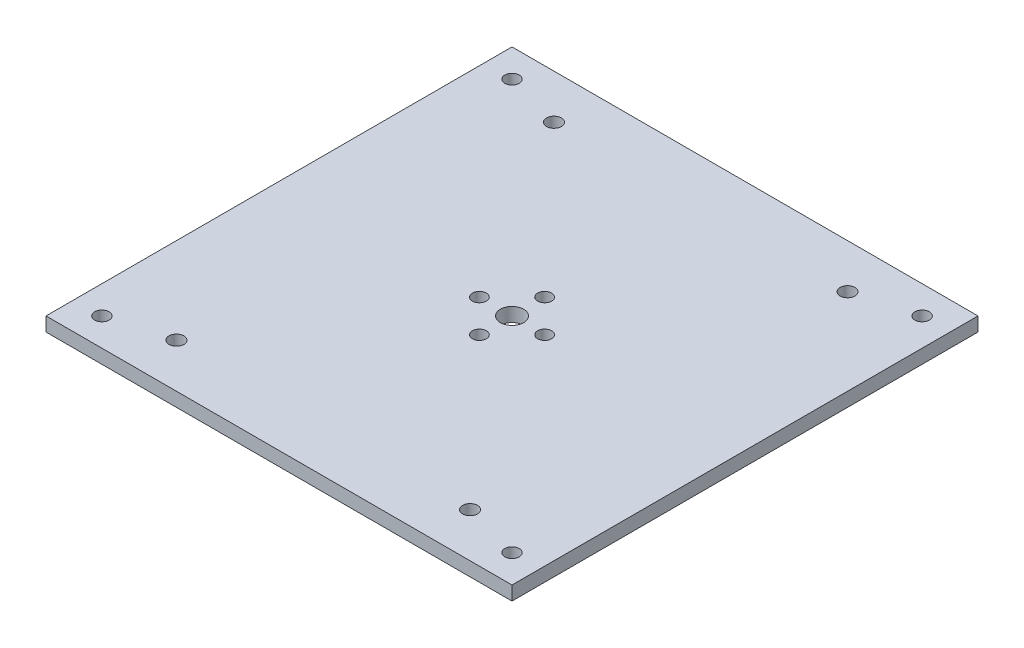
ISO-10303-21;
HEADER;
FILE_DESCRIPTION(('STEP AP214'),'2;1');
FILE_NAME('part.step','',(''),(''),'','','');
FILE_SCHEMA(('AUTOMOTIVE_DESIGN { 1 0 10303 214 1 1 1 1 }'));
ENDSEC;
DATA;
#1=APPLICATION_CONTEXT('core data for automotive mechanical design processes');
#2=APPLICATION_PROTOCOL_DEFINITION('international standard','automotive_design',2000,#1);
#3=PRODUCT_CONTEXT('',#1,'mechanical');
#4=PRODUCT('Part','Part','',(#3));
#5=PRODUCT_RELATED_PRODUCT_CATEGORY('part','',(#4));
#6=PRODUCT_DEFINITION_FORMATION('','',#4);
#7=PRODUCT_DEFINITION_CONTEXT('part definition',#1,'design');
#8=PRODUCT_DEFINITION('design','',#6,#7);
#9=PRODUCT_DEFINITION_SHAPE('','',#8);
#10=(LENGTH_UNIT() NAMED_UNIT(*) SI_UNIT(.MILLI.,.METRE.));
#11=(NAMED_UNIT(*) PLANE_ANGLE_UNIT() SI_UNIT($,.RADIAN.));
#12=(NAMED_UNIT(*) SI_UNIT($,.STERADIAN.) SOLID_ANGLE_UNIT());
#13=UNCERTAINTY_MEASURE_WITH_UNIT(LENGTH_MEASURE(1.E-05),#10,'distance_accuracy_value','');
#14=(GEOMETRIC_REPRESENTATION_CONTEXT(3) GLOBAL_UNCERTAINTY_ASSIGNED_CONTEXT((#13)) GLOBAL_UNIT_ASSIGNED_CONTEXT((#10,
#11,#12)) REPRESENTATION_CONTEXT('',''));
#15=CARTESIAN_POINT('',(0.,0.,0.));
#16=DIRECTION('',(0.,0.,1.));
#17=DIRECTION('',(1.,0.,0.));
#18=AXIS2_PLACEMENT_3D('',#15,#16,#17);
#19=CARTESIAN_POINT('',(-50.,3.,-50.));
#20=DIRECTION('',(1.,0.,0.));
#21=DIRECTION('',(0.,0.,-1.));
#22=AXIS2_PLACEMENT_3D('',#19,#20,#21);
#23=PLANE('',#22);
#24=DIRECTION('',(0.,0.,1.));
#25=VECTOR('',#24,1.);
#26=CARTESIAN_POINT('',(-50.,0.,-50.));
#27=LINE('',#26,#25);
#28=CARTESIAN_POINT('',(-50.,0.,-50.));
#29=VERTEX_POINT('',#28);
#30=CARTESIAN_POINT('',(-50.,0.,50.));
#31=VERTEX_POINT('',#30);
#32=EDGE_CURVE('E98',#29,#31,#27,.T.);
#33=ORIENTED_EDGE('',*,*,#32,.T.);
#34=DIRECTION('',(0.,-1.,0.));
#35=VECTOR('',#34,1.);
#36=CARTESIAN_POINT('',(-50.,3.,50.));
#37=LINE('',#36,#35);
#38=CARTESIAN_POINT('',(-50.,3.,50.));
#39=VERTEX_POINT('',#38);
#40=EDGE_CURVE('E11',#39,#31,#37,.T.);
#41=ORIENTED_EDGE('',*,*,#40,.F.);
#42=DIRECTION('',(0.,0.,1.));
#43=VECTOR('',#42,1.);
#44=CARTESIAN_POINT('',(-50.,3.,-50.));
#45=LINE('',#44,#43);
#46=CARTESIAN_POINT('',(-50.,3.,-50.));
#47=VERTEX_POINT('',#46);
#48=EDGE_CURVE('E85',#47,#39,#45,.T.);
#49=ORIENTED_EDGE('',*,*,#48,.F.);
#50=DIRECTION('',(0.,-1.,0.));
#51=VECTOR('',#50,1.);
#52=CARTESIAN_POINT('',(-50.,3.,-50.));
#53=LINE('',#52,#51);
#54=EDGE_CURVE('E94',#47,#29,#53,.T.);
#55=ORIENTED_EDGE('',*,*,#54,.T.);
#56=EDGE_LOOP('',(#33,#41,#49,#55));
#57=FACE_BOUND('',#56,.T.);
#58=ADVANCED_FACE('F32',(#57),#23,.F.);
#59=CARTESIAN_POINT('',(-50.,3.,50.));
#60=DIRECTION('',(0.,0.,-1.));
#61=DIRECTION('',(-1.,0.,0.));
#62=AXIS2_PLACEMENT_3D('',#59,#60,#61);
#63=PLANE('',#62);
#64=DIRECTION('',(1.,0.,0.));
#65=VECTOR('',#64,1.);
#66=CARTESIAN_POINT('',(-50.,0.,50.));
#67=LINE('',#66,#65);
#68=CARTESIAN_POINT('',(50.,0.,50.));
#69=VERTEX_POINT('',#68);
#70=EDGE_CURVE('E89',#31,#69,#67,.T.);
#71=ORIENTED_EDGE('',*,*,#70,.T.);
#72=DIRECTION('',(0.,-1.,0.));
#73=VECTOR('',#72,1.);
#74=CARTESIAN_POINT('',(50.,3.,50.));
#75=LINE('',#74,#73);
#76=CARTESIAN_POINT('',(50.,3.,50.));
#77=VERTEX_POINT('',#76);
#78=EDGE_CURVE('E41',#77,#69,#75,.T.);
#79=ORIENTED_EDGE('',*,*,#78,.F.);
#80=DIRECTION('',(1.,0.,0.));
#81=VECTOR('',#80,1.);
#82=CARTESIAN_POINT('',(-50.,3.,50.));
#83=LINE('',#82,#81);
#84=EDGE_CURVE('E80',#39,#77,#83,.T.);
#85=ORIENTED_EDGE('',*,*,#84,.F.);
#86=ORIENTED_EDGE('',*,*,#40,.T.);
#87=EDGE_LOOP('',(#71,#79,#85,#86));
#88=FACE_BOUND('',#87,.T.);
#89=ADVANCED_FACE('F88',(#88),#63,.F.);
#90=CARTESIAN_POINT('',(50.,3.,-50.));
#91=DIRECTION('',(-1.,0.,0.));
#92=DIRECTION('',(0.,0.,1.));
#93=AXIS2_PLACEMENT_3D('',#90,#91,#92);
#94=PLANE('',#93);
#95=DIRECTION('',(0.,0.,-1.));
#96=VECTOR('',#95,1.);
#97=CARTESIAN_POINT('',(50.,0.,-50.));
#98=LINE('',#97,#96);
#99=CARTESIAN_POINT('',(50.,0.,-50.));
#100=VERTEX_POINT('',#99);
#101=EDGE_CURVE('E67',#69,#100,#98,.T.);
#102=ORIENTED_EDGE('',*,*,#101,.T.);
#103=DIRECTION('',(0.,-1.,0.));
#104=VECTOR('',#103,1.);
#105=CARTESIAN_POINT('',(50.,3.,-50.));
#106=LINE('',#105,#104);
#107=CARTESIAN_POINT('',(50.,3.,-50.));
#108=VERTEX_POINT('',#107);
#109=EDGE_CURVE('E90',#108,#100,#106,.T.);
#110=ORIENTED_EDGE('',*,*,#109,.F.);
#111=DIRECTION('',(0.,0.,-1.));
#112=VECTOR('',#111,1.);
#113=CARTESIAN_POINT('',(50.,3.,-50.));
#114=LINE('',#113,#112);
#115=EDGE_CURVE('E83',#77,#108,#114,.T.);
#116=ORIENTED_EDGE('',*,*,#115,.F.);
#117=ORIENTED_EDGE('',*,*,#78,.T.);
#118=EDGE_LOOP('',(#102,#110,#116,#117));
#119=FACE_BOUND('',#118,.T.);
#120=ADVANCED_FACE('F92',(#119),#94,.F.);
#121=CARTESIAN_POINT('',(-50.,3.,-50.));
#122=DIRECTION('',(0.,0.,1.));
#123=DIRECTION('',(1.,0.,0.));
#124=AXIS2_PLACEMENT_3D('',#121,#122,#123);
#125=PLANE('',#124);
#126=DIRECTION('',(-1.,0.,0.));
#127=VECTOR('',#126,1.);
#128=CARTESIAN_POINT('',(-50.,0.,-50.));
#129=LINE('',#128,#127);
#130=EDGE_CURVE('E73',#100,#29,#129,.T.);
#131=ORIENTED_EDGE('',*,*,#130,.T.);
#132=ORIENTED_EDGE('',*,*,#54,.F.);
#133=DIRECTION('',(-1.,0.,0.));
#134=VECTOR('',#133,1.);
#135=CARTESIAN_POINT('',(-50.,3.,-50.));
#136=LINE('',#135,#134);
#137=EDGE_CURVE('E50',#108,#47,#136,.T.);
#138=ORIENTED_EDGE('',*,*,#137,.F.);
#139=ORIENTED_EDGE('',*,*,#109,.T.);
#140=EDGE_LOOP('',(#131,#132,#138,#139));
#141=FACE_BOUND('',#140,.T.);
#142=ADVANCED_FACE('F181',(#141),#125,.F.);
#143=CARTESIAN_POINT('',(0.,3.,0.));
#144=DIRECTION('',(0.,1.,0.));
#145=DIRECTION('',(0.,0.,1.));
#146=AXIS2_PLACEMENT_3D('',#143,#144,#145);
#147=PLANE('',#146);
#148=CARTESIAN_POINT('',(0.,3.,-7.));
#149=DIRECTION('',(0.,1.,0.));
#150=DIRECTION('',(0.,0.,1.));
#151=AXIS2_PLACEMENT_3D('',#148,#149,#150);
#152=CIRCLE('',#151,1.5);
#153=CARTESIAN_POINT('',(0.,3.,-5.5));
#154=VERTEX_POINT('',#153);
#155=EDGE_CURVE('E352',#154,#154,#152,.T.);
#156=ORIENTED_EDGE('',*,*,#155,.F.);
#157=EDGE_LOOP('',(#156));
#158=FACE_BOUND('',#157,.T.);
#159=CARTESIAN_POINT('',(7.,3.,0.));
#160=DIRECTION('',(0.,1.,0.));
#161=DIRECTION('',(0.,0.,1.));
#162=AXIS2_PLACEMENT_3D('',#159,#160,#161);
#163=CIRCLE('',#162,1.5);
#164=CARTESIAN_POINT('',(7.,3.,1.5));
#165=VERTEX_POINT('',#164);
#166=EDGE_CURVE('E353',#165,#165,#163,.T.);
#167=ORIENTED_EDGE('',*,*,#166,.F.);
#168=EDGE_LOOP('',(#167));
#169=FACE_BOUND('',#168,.T.);
#170=CARTESIAN_POINT('',(0.,3.,7.));
#171=DIRECTION('',(0.,1.,0.));
#172=DIRECTION('',(0.,0.,1.));
#173=AXIS2_PLACEMENT_3D('',#170,#171,#172);
#174=CIRCLE('',#173,1.5);
#175=CARTESIAN_POINT('',(0.,3.,8.5));
#176=VERTEX_POINT('',#175);
#177=EDGE_CURVE('E357',#176,#176,#174,.T.);
#178=ORIENTED_EDGE('',*,*,#177,.F.);
#179=EDGE_LOOP('',(#178));
#180=FACE_BOUND('',#179,.T.);
#181=CARTESIAN_POINT('',(-7.,3.,0.));
#182=DIRECTION('',(0.,1.,0.));
#183=DIRECTION('',(0.,0.,1.));
#184=AXIS2_PLACEMENT_3D('',#181,#182,#183);
#185=CIRCLE('',#184,1.5);
#186=CARTESIAN_POINT('',(-7.,3.,1.5));
#187=VERTEX_POINT('',#186);
#188=EDGE_CURVE('E359',#187,#187,#185,.T.);
#189=ORIENTED_EDGE('',*,*,#188,.F.);
#190=EDGE_LOOP('',(#189));
#191=FACE_BOUND('',#190,.T.);
#192=CARTESIAN_POINT('',(0.,3.,0.));
#193=DIRECTION('',(0.,1.,0.));
#194=DIRECTION('',(0.,0.,1.));
#195=AXIS2_PLACEMENT_3D('',#192,#193,#194);
#196=CIRCLE('',#195,2.5);
#197=CARTESIAN_POINT('',(0.,3.,2.5));
#198=VERTEX_POINT('',#197);
#199=EDGE_CURVE('E137',#198,#198,#196,.T.);
#200=ORIENTED_EDGE('',*,*,#199,.F.);
#201=EDGE_LOOP('',(#200));
#202=FACE_BOUND('',#201,.T.);
#203=CARTESIAN_POINT('',(31.5,3.,-40.5));
#204=DIRECTION('',(0.,1.,0.));
#205=DIRECTION('',(0.,0.,1.));
#206=AXIS2_PLACEMENT_3D('',#203,#204,#205);
#207=CIRCLE('',#206,1.6);
#208=CARTESIAN_POINT('',(31.5,3.,-38.9));
#209=VERTEX_POINT('',#208);
#210=EDGE_CURVE('E156',#209,#209,#207,.T.);
#211=ORIENTED_EDGE('',*,*,#210,.F.);
#212=EDGE_LOOP('',(#211));
#213=FACE_BOUND('',#212,.T.);
#214=CARTESIAN_POINT('',(-31.5,3.,40.5));
#215=DIRECTION('',(0.,1.,0.));
#216=DIRECTION('',(0.,0.,1.));
#217=AXIS2_PLACEMENT_3D('',#214,#215,#216);
#218=CIRCLE('',#217,1.6);
#219=CARTESIAN_POINT('',(-31.5,3.,42.1));
#220=VERTEX_POINT('',#219);
#221=EDGE_CURVE('E151',#220,#220,#218,.T.);
#222=ORIENTED_EDGE('',*,*,#221,.F.);
#223=EDGE_LOOP('',(#222));
#224=FACE_BOUND('',#223,.T.);
#225=CARTESIAN_POINT('',(31.5,3.,40.5));
#226=DIRECTION('',(0.,1.,0.));
#227=DIRECTION('',(0.,0.,1.));
#228=AXIS2_PLACEMENT_3D('',#225,#226,#227);
#229=CIRCLE('',#228,1.6);
#230=CARTESIAN_POINT('',(31.5,3.,42.1));
#231=VERTEX_POINT('',#230);
#232=EDGE_CURVE('E147',#231,#231,#229,.T.);
#233=ORIENTED_EDGE('',*,*,#232,.F.);
#234=EDGE_LOOP('',(#233));
#235=FACE_BOUND('',#234,.T.);
#236=CARTESIAN_POINT('',(-31.5,3.,-40.5));
#237=DIRECTION('',(0.,1.,0.));
#238=DIRECTION('',(0.,0.,1.));
#239=AXIS2_PLACEMENT_3D('',#236,#237,#238);
#240=CIRCLE('',#239,1.6);
#241=CARTESIAN_POINT('',(-31.5,3.,-38.9));
#242=VERTEX_POINT('',#241);
#243=EDGE_CURVE('E123',#242,#242,#240,.T.);
#244=ORIENTED_EDGE('',*,*,#243,.F.);
#245=EDGE_LOOP('',(#244));
#246=FACE_BOUND('',#245,.T.);
#247=CARTESIAN_POINT('',(-44.,3.,44.));
#248=DIRECTION('',(0.,1.,0.));
#249=DIRECTION('',(0.,0.,1.));
#250=AXIS2_PLACEMENT_3D('',#247,#248,#249);
#251=CIRCLE('',#250,1.55);
#252=CARTESIAN_POINT('',(-44.,3.,45.55));
#253=VERTEX_POINT('',#252);
#254=EDGE_CURVE('E132',#253,#253,#251,.T.);
#255=ORIENTED_EDGE('',*,*,#254,.F.);
#256=EDGE_LOOP('',(#255));
#257=FACE_BOUND('',#256,.T.);
#258=CARTESIAN_POINT('',(44.,3.,44.));
#259=DIRECTION('',(0.,1.,0.));
#260=DIRECTION('',(0.,0.,1.));
#261=AXIS2_PLACEMENT_3D('',#258,#259,#260);
#262=CIRCLE('',#261,1.55);
#263=CARTESIAN_POINT('',(44.,3.,45.55));
#264=VERTEX_POINT('',#263);
#265=EDGE_CURVE('E168',#264,#264,#262,.T.);
#266=ORIENTED_EDGE('',*,*,#265,.F.);
#267=EDGE_LOOP('',(#266));
#268=FACE_BOUND('',#267,.T.);
#269=CARTESIAN_POINT('',(44.,3.,-44.));
#270=DIRECTION('',(0.,1.,0.));
#271=DIRECTION('',(0.,0.,1.));
#272=AXIS2_PLACEMENT_3D('',#269,#270,#271);
#273=CIRCLE('',#272,1.55);
#274=CARTESIAN_POINT('',(44.,3.,-42.45));
#275=VERTEX_POINT('',#274);
#276=EDGE_CURVE('E165',#275,#275,#273,.T.);
#277=ORIENTED_EDGE('',*,*,#276,.F.);
#278=EDGE_LOOP('',(#277));
#279=FACE_BOUND('',#278,.T.);
#280=CARTESIAN_POINT('',(-44.,3.,-44.));
#281=DIRECTION('',(0.,1.,0.));
#282=DIRECTION('',(0.,0.,1.));
#283=AXIS2_PLACEMENT_3D('',#280,#281,#282);
#284=CIRCLE('',#283,1.55);
#285=CARTESIAN_POINT('',(-44.,3.,-42.45));
#286=VERTEX_POINT('',#285);
#287=EDGE_CURVE('E111',#286,#286,#284,.T.);
#288=ORIENTED_EDGE('',*,*,#287,.F.);
#289=EDGE_LOOP('',(#288));
#290=FACE_BOUND('',#289,.T.);
#291=ORIENTED_EDGE('',*,*,#48,.T.);
#292=ORIENTED_EDGE('',*,*,#84,.T.);
#293=ORIENTED_EDGE('',*,*,#115,.T.);
#294=ORIENTED_EDGE('',*,*,#137,.T.);
#295=EDGE_LOOP('',(#291,#292,#293,#294));
#296=FACE_BOUND('',#295,.T.);
#297=ADVANCED_FACE('F81',(#158,#169,#180,#191,#202,#213,#224,#235,#246,#257,#268,#279,#290,
#296),#147,.T.);
#298=CARTESIAN_POINT('',(0.,0.,0.));
#299=DIRECTION('',(0.,1.,0.));
#300=DIRECTION('',(0.,0.,1.));
#301=AXIS2_PLACEMENT_3D('',#298,#299,#300);
#302=PLANE('',#301);
#303=CARTESIAN_POINT('',(0.,0.,-7.));
#304=DIRECTION('',(0.,1.,0.));
#305=DIRECTION('',(0.,0.,1.));
#306=AXIS2_PLACEMENT_3D('',#303,#304,#305);
#307=CIRCLE('',#306,1.5);
#308=CARTESIAN_POINT('',(0.,0.,-5.5));
#309=VERTEX_POINT('',#308);
#310=EDGE_CURVE('E35',#309,#309,#307,.T.);
#311=ORIENTED_EDGE('',*,*,#310,.T.);
#312=EDGE_LOOP('',(#311));
#313=FACE_BOUND('',#312,.T.);
#314=CARTESIAN_POINT('',(7.,0.,0.));
#315=DIRECTION('',(0.,1.,0.));
#316=DIRECTION('',(0.,0.,1.));
#317=AXIS2_PLACEMENT_3D('',#314,#315,#316);
#318=CIRCLE('',#317,1.5);
#319=CARTESIAN_POINT('',(7.,0.,1.5));
#320=VERTEX_POINT('',#319);
#321=EDGE_CURVE('E142',#320,#320,#318,.T.);
#322=ORIENTED_EDGE('',*,*,#321,.T.);
#323=EDGE_LOOP('',(#322));
#324=FACE_BOUND('',#323,.T.);
#325=CARTESIAN_POINT('',(0.,0.,7.));
#326=DIRECTION('',(0.,1.,0.));
#327=DIRECTION('',(0.,0.,1.));
#328=AXIS2_PLACEMENT_3D('',#325,#326,#327);
#329=CIRCLE('',#328,1.5);
#330=CARTESIAN_POINT('',(0.,0.,8.5));
#331=VERTEX_POINT('',#330);
#332=EDGE_CURVE('E140',#331,#331,#329,.T.);
#333=ORIENTED_EDGE('',*,*,#332,.T.);
#334=EDGE_LOOP('',(#333));
#335=FACE_BOUND('',#334,.T.);
#336=CARTESIAN_POINT('',(-7.,0.,0.));
#337=DIRECTION('',(0.,1.,0.));
#338=DIRECTION('',(0.,0.,1.));
#339=AXIS2_PLACEMENT_3D('',#336,#337,#338);
#340=CIRCLE('',#339,1.5);
#341=CARTESIAN_POINT('',(-7.,0.,1.5));
#342=VERTEX_POINT('',#341);
#343=EDGE_CURVE('E136',#342,#342,#340,.T.);
#344=ORIENTED_EDGE('',*,*,#343,.T.);
#345=EDGE_LOOP('',(#344));
#346=FACE_BOUND('',#345,.T.);
#347=CARTESIAN_POINT('',(0.,0.,0.));
#348=DIRECTION('',(0.,1.,0.));
#349=DIRECTION('',(0.,0.,1.));
#350=AXIS2_PLACEMENT_3D('',#347,#348,#349);
#351=CIRCLE('',#350,2.5);
#352=CARTESIAN_POINT('',(0.,0.,2.5));
#353=VERTEX_POINT('',#352);
#354=EDGE_CURVE('E133',#353,#353,#351,.T.);
#355=ORIENTED_EDGE('',*,*,#354,.T.);
#356=EDGE_LOOP('',(#355));
#357=FACE_BOUND('',#356,.T.);
#358=CARTESIAN_POINT('',(31.5,0.,-40.5));
#359=DIRECTION('',(0.,1.,0.));
#360=DIRECTION('',(0.,0.,1.));
#361=AXIS2_PLACEMENT_3D('',#358,#359,#360);
#362=CIRCLE('',#361,1.6);
#363=CARTESIAN_POINT('',(31.5,0.,-38.9));
#364=VERTEX_POINT('',#363);
#365=EDGE_CURVE('E129',#364,#364,#362,.T.);
#366=ORIENTED_EDGE('',*,*,#365,.T.);
#367=EDGE_LOOP('',(#366));
#368=FACE_BOUND('',#367,.T.);
#369=CARTESIAN_POINT('',(-31.5,0.,40.5));
#370=DIRECTION('',(0.,1.,0.));
#371=DIRECTION('',(0.,0.,1.));
#372=AXIS2_PLACEMENT_3D('',#369,#370,#371);
#373=CIRCLE('',#372,1.6);
#374=CARTESIAN_POINT('',(-31.5,0.,42.1));
#375=VERTEX_POINT('',#374);
#376=EDGE_CURVE('E126',#375,#375,#373,.T.);
#377=ORIENTED_EDGE('',*,*,#376,.T.);
#378=EDGE_LOOP('',(#377));
#379=FACE_BOUND('',#378,.T.);
#380=CARTESIAN_POINT('',(31.5,0.,40.5));
#381=DIRECTION('',(0.,1.,0.));
#382=DIRECTION('',(0.,0.,1.));
#383=AXIS2_PLACEMENT_3D('',#380,#381,#382);
#384=CIRCLE('',#383,1.6);
#385=CARTESIAN_POINT('',(31.5,0.,42.1));
#386=VERTEX_POINT('',#385);
#387=EDGE_CURVE('E122',#386,#386,#384,.T.);
#388=ORIENTED_EDGE('',*,*,#387,.T.);
#389=EDGE_LOOP('',(#388));
#390=FACE_BOUND('',#389,.T.);
#391=CARTESIAN_POINT('',(-31.5,0.,-40.5));
#392=DIRECTION('',(0.,1.,0.));
#393=DIRECTION('',(0.,0.,1.));
#394=AXIS2_PLACEMENT_3D('',#391,#392,#393);
#395=CIRCLE('',#394,1.6);
#396=CARTESIAN_POINT('',(-31.5,0.,-38.9));
#397=VERTEX_POINT('',#396);
#398=EDGE_CURVE('E119',#397,#397,#395,.T.);
#399=ORIENTED_EDGE('',*,*,#398,.T.);
#400=EDGE_LOOP('',(#399));
#401=FACE_BOUND('',#400,.T.);
#402=CARTESIAN_POINT('',(-44.,0.,44.));
#403=DIRECTION('',(0.,1.,0.));
#404=DIRECTION('',(0.,0.,1.));
#405=AXIS2_PLACEMENT_3D('',#402,#403,#404);
#406=CIRCLE('',#405,1.55);
#407=CARTESIAN_POINT('',(-44.,0.,45.55));
#408=VERTEX_POINT('',#407);
#409=EDGE_CURVE('E101',#408,#408,#406,.T.);
#410=ORIENTED_EDGE('',*,*,#409,.T.);
#411=EDGE_LOOP('',(#410));
#412=FACE_BOUND('',#411,.T.);
#413=CARTESIAN_POINT('',(44.,0.,44.));
#414=DIRECTION('',(0.,1.,0.));
#415=DIRECTION('',(0.,0.,1.));
#416=AXIS2_PLACEMENT_3D('',#413,#414,#415);
#417=CIRCLE('',#416,1.55);
#418=CARTESIAN_POINT('',(44.,0.,45.55));
#419=VERTEX_POINT('',#418);
#420=EDGE_CURVE('E114',#419,#419,#417,.T.);
#421=ORIENTED_EDGE('',*,*,#420,.T.);
#422=EDGE_LOOP('',(#421));
#423=FACE_BOUND('',#422,.T.);
#424=CARTESIAN_POINT('',(44.,0.,-44.));
#425=DIRECTION('',(0.,1.,0.));
#426=DIRECTION('',(0.,0.,1.));
#427=AXIS2_PLACEMENT_3D('',#424,#425,#426);
#428=CIRCLE('',#427,1.55);
#429=CARTESIAN_POINT('',(44.,0.,-42.45));
#430=VERTEX_POINT('',#429);
#431=EDGE_CURVE('E110',#430,#430,#428,.T.);
#432=ORIENTED_EDGE('',*,*,#431,.T.);
#433=EDGE_LOOP('',(#432));
#434=FACE_BOUND('',#433,.T.);
#435=CARTESIAN_POINT('',(-44.,0.,-44.));
#436=DIRECTION('',(0.,1.,0.));
#437=DIRECTION('',(0.,0.,1.));
#438=AXIS2_PLACEMENT_3D('',#435,#436,#437);
#439=CIRCLE('',#438,1.55);
#440=CARTESIAN_POINT('',(-44.,0.,-42.45));
#441=VERTEX_POINT('',#440);
#442=EDGE_CURVE('E107',#441,#441,#439,.T.);
#443=ORIENTED_EDGE('',*,*,#442,.T.);
#444=EDGE_LOOP('',(#443));
#445=FACE_BOUND('',#444,.T.);
#446=ORIENTED_EDGE('',*,*,#32,.F.);
#447=ORIENTED_EDGE('',*,*,#130,.F.);
#448=ORIENTED_EDGE('',*,*,#101,.F.);
#449=ORIENTED_EDGE('',*,*,#70,.F.);
#450=EDGE_LOOP('',(#446,#447,#448,#449));
#451=FACE_BOUND('',#450,.T.);
#452=ADVANCED_FACE('F180',(#313,#324,#335,#346,#357,#368,#379,#390,#401,#412,#423,#434,#445,
#451),#302,.F.);
#453=CARTESIAN_POINT('',(-44.,-7.,-44.));
#454=DIRECTION('',(0.,1.,0.));
#455=DIRECTION('',(0.,0.,1.));
#456=AXIS2_PLACEMENT_3D('',#453,#454,#455);
#457=CYLINDRICAL_SURFACE('',#456,1.55);
#458=ORIENTED_EDGE('',*,*,#287,.T.);
#459=EDGE_LOOP('',(#458));
#460=FACE_BOUND('',#459,.T.);
#461=ORIENTED_EDGE('',*,*,#442,.F.);
#462=EDGE_LOOP('',(#461));
#463=FACE_BOUND('',#462,.T.);
#464=ADVANCED_FACE('F176',(#460,#463),#457,.F.);
#465=CARTESIAN_POINT('',(44.,-7.,-44.));
#466=DIRECTION('',(0.,1.,0.));
#467=DIRECTION('',(0.,0.,1.));
#468=AXIS2_PLACEMENT_3D('',#465,#466,#467);
#469=CYLINDRICAL_SURFACE('',#468,1.55);
#470=ORIENTED_EDGE('',*,*,#276,.T.);
#471=EDGE_LOOP('',(#470));
#472=FACE_BOUND('',#471,.T.);
#473=ORIENTED_EDGE('',*,*,#431,.F.);
#474=EDGE_LOOP('',(#473));
#475=FACE_BOUND('',#474,.T.);
#476=ADVANCED_FACE('F220',(#472,#475),#469,.F.);
#477=CARTESIAN_POINT('',(44.,-7.,44.));
#478=DIRECTION('',(0.,1.,0.));
#479=DIRECTION('',(0.,0.,1.));
#480=AXIS2_PLACEMENT_3D('',#477,#478,#479);
#481=CYLINDRICAL_SURFACE('',#480,1.55);
#482=ORIENTED_EDGE('',*,*,#265,.T.);
#483=EDGE_LOOP('',(#482));
#484=FACE_BOUND('',#483,.T.);
#485=ORIENTED_EDGE('',*,*,#420,.F.);
#486=EDGE_LOOP('',(#485));
#487=FACE_BOUND('',#486,.T.);
#488=ADVANCED_FACE('F229',(#484,#487),#481,.F.);
#489=CARTESIAN_POINT('',(-44.,-7.,44.));
#490=DIRECTION('',(0.,1.,0.));
#491=DIRECTION('',(0.,0.,1.));
#492=AXIS2_PLACEMENT_3D('',#489,#490,#491);
#493=CYLINDRICAL_SURFACE('',#492,1.55);
#494=ORIENTED_EDGE('',*,*,#254,.T.);
#495=EDGE_LOOP('',(#494));
#496=FACE_BOUND('',#495,.T.);
#497=ORIENTED_EDGE('',*,*,#409,.F.);
#498=EDGE_LOOP('',(#497));
#499=FACE_BOUND('',#498,.T.);
#500=ADVANCED_FACE('F239',(#496,#499),#493,.F.);
#501=CARTESIAN_POINT('',(-31.5,-7.,-40.5));
#502=DIRECTION('',(0.,1.,0.));
#503=DIRECTION('',(0.,0.,1.));
#504=AXIS2_PLACEMENT_3D('',#501,#502,#503);
#505=CYLINDRICAL_SURFACE('',#504,1.6);
#506=ORIENTED_EDGE('',*,*,#243,.T.);
#507=EDGE_LOOP('',(#506));
#508=FACE_BOUND('',#507,.T.);
#509=ORIENTED_EDGE('',*,*,#398,.F.);
#510=EDGE_LOOP('',(#509));
#511=FACE_BOUND('',#510,.T.);
#512=ADVANCED_FACE('F249',(#508,#511),#505,.F.);
#513=CARTESIAN_POINT('',(31.5,-7.,40.5));
#514=DIRECTION('',(0.,1.,0.));
#515=DIRECTION('',(0.,0.,1.));
#516=AXIS2_PLACEMENT_3D('',#513,#514,#515);
#517=CYLINDRICAL_SURFACE('',#516,1.6);
#518=ORIENTED_EDGE('',*,*,#232,.T.);
#519=EDGE_LOOP('',(#518));
#520=FACE_BOUND('',#519,.T.);
#521=ORIENTED_EDGE('',*,*,#387,.F.);
#522=EDGE_LOOP('',(#521));
#523=FACE_BOUND('',#522,.T.);
#524=ADVANCED_FACE('F259',(#520,#523),#517,.F.);
#525=CARTESIAN_POINT('',(-31.5,-7.,40.5));
#526=DIRECTION('',(0.,1.,0.));
#527=DIRECTION('',(0.,0.,1.));
#528=AXIS2_PLACEMENT_3D('',#525,#526,#527);
#529=CYLINDRICAL_SURFACE('',#528,1.6);
#530=ORIENTED_EDGE('',*,*,#221,.T.);
#531=EDGE_LOOP('',(#530));
#532=FACE_BOUND('',#531,.T.);
#533=ORIENTED_EDGE('',*,*,#376,.F.);
#534=EDGE_LOOP('',(#533));
#535=FACE_BOUND('',#534,.T.);
#536=ADVANCED_FACE('F269',(#532,#535),#529,.F.);
#537=CARTESIAN_POINT('',(31.5,-7.,-40.5));
#538=DIRECTION('',(0.,1.,0.));
#539=DIRECTION('',(0.,0.,1.));
#540=AXIS2_PLACEMENT_3D('',#537,#538,#539);
#541=CYLINDRICAL_SURFACE('',#540,1.6);
#542=ORIENTED_EDGE('',*,*,#210,.T.);
#543=EDGE_LOOP('',(#542));
#544=FACE_BOUND('',#543,.T.);
#545=ORIENTED_EDGE('',*,*,#365,.F.);
#546=EDGE_LOOP('',(#545));
#547=FACE_BOUND('',#546,.T.);
#548=ADVANCED_FACE('F278',(#544,#547),#541,.F.);
#549=CARTESIAN_POINT('',(0.,-7.,0.));
#550=DIRECTION('',(0.,1.,0.));
#551=DIRECTION('',(0.,0.,1.));
#552=AXIS2_PLACEMENT_3D('',#549,#550,#551);
#553=CYLINDRICAL_SURFACE('',#552,2.5);
#554=ORIENTED_EDGE('',*,*,#199,.T.);
#555=EDGE_LOOP('',(#554));
#556=FACE_BOUND('',#555,.T.);
#557=ORIENTED_EDGE('',*,*,#354,.F.);
#558=EDGE_LOOP('',(#557));
#559=FACE_BOUND('',#558,.T.);
#560=ADVANCED_FACE('F287',(#556,#559),#553,.F.);
#561=CARTESIAN_POINT('',(-7.,-7.,0.));
#562=DIRECTION('',(0.,1.,0.));
#563=DIRECTION('',(0.,0.,1.));
#564=AXIS2_PLACEMENT_3D('',#561,#562,#563);
#565=CYLINDRICAL_SURFACE('',#564,1.5);
#566=ORIENTED_EDGE('',*,*,#188,.T.);
#567=EDGE_LOOP('',(#566));
#568=FACE_BOUND('',#567,.T.);
#569=ORIENTED_EDGE('',*,*,#343,.F.);
#570=EDGE_LOOP('',(#569));
#571=FACE_BOUND('',#570,.T.);
#572=ADVANCED_FACE('F306',(#568,#571),#565,.F.);
#573=CARTESIAN_POINT('',(0.,-7.,7.));
#574=DIRECTION('',(0.,1.,0.));
#575=DIRECTION('',(0.,0.,1.));
#576=AXIS2_PLACEMENT_3D('',#573,#574,#575);
#577=CYLINDRICAL_SURFACE('',#576,1.5);
#578=ORIENTED_EDGE('',*,*,#177,.T.);
#579=EDGE_LOOP('',(#578));
#580=FACE_BOUND('',#579,.T.);
#581=ORIENTED_EDGE('',*,*,#332,.F.);
#582=EDGE_LOOP('',(#581));
#583=FACE_BOUND('',#582,.T.);
#584=ADVANCED_FACE('F316',(#580,#583),#577,.F.);
#585=CARTESIAN_POINT('',(7.,-7.,0.));
#586=DIRECTION('',(0.,1.,0.));
#587=DIRECTION('',(0.,0.,1.));
#588=AXIS2_PLACEMENT_3D('',#585,#586,#587);
#589=CYLINDRICAL_SURFACE('',#588,1.5);
#590=ORIENTED_EDGE('',*,*,#166,.T.);
#591=EDGE_LOOP('',(#590));
#592=FACE_BOUND('',#591,.T.);
#593=ORIENTED_EDGE('',*,*,#321,.F.);
#594=EDGE_LOOP('',(#593));
#595=FACE_BOUND('',#594,.T.);
#596=ADVANCED_FACE('F326',(#592,#595),#589,.F.);
#597=CARTESIAN_POINT('',(0.,-7.,-7.));
#598=DIRECTION('',(0.,1.,0.));
#599=DIRECTION('',(0.,0.,1.));
#600=AXIS2_PLACEMENT_3D('',#597,#598,#599);
#601=CYLINDRICAL_SURFACE('',#600,1.5);
#602=ORIENTED_EDGE('',*,*,#155,.T.);
#603=EDGE_LOOP('',(#602));
#604=FACE_BOUND('',#603,.T.);
#605=ORIENTED_EDGE('',*,*,#310,.F.);
#606=EDGE_LOOP('',(#605));
#607=FACE_BOUND('',#606,.T.);
#608=ADVANCED_FACE('F336',(#604,#607),#601,.F.);
#609=CLOSED_SHELL('',(#58,#89,#120,#142,#297,#452,#464,#476,#488,#500,#512,#524,#536,#548,#560,
#572,#584,#596,#608));
#610=MANIFOLD_SOLID_BREP('B2',#609);
#611=ADVANCED_BREP_SHAPE_REPRESENTATION('',(#18,#610),#14);
#612=SHAPE_DEFINITION_REPRESENTATION(#9,#611);
ENDSEC;
END-ISO-10303-21;
